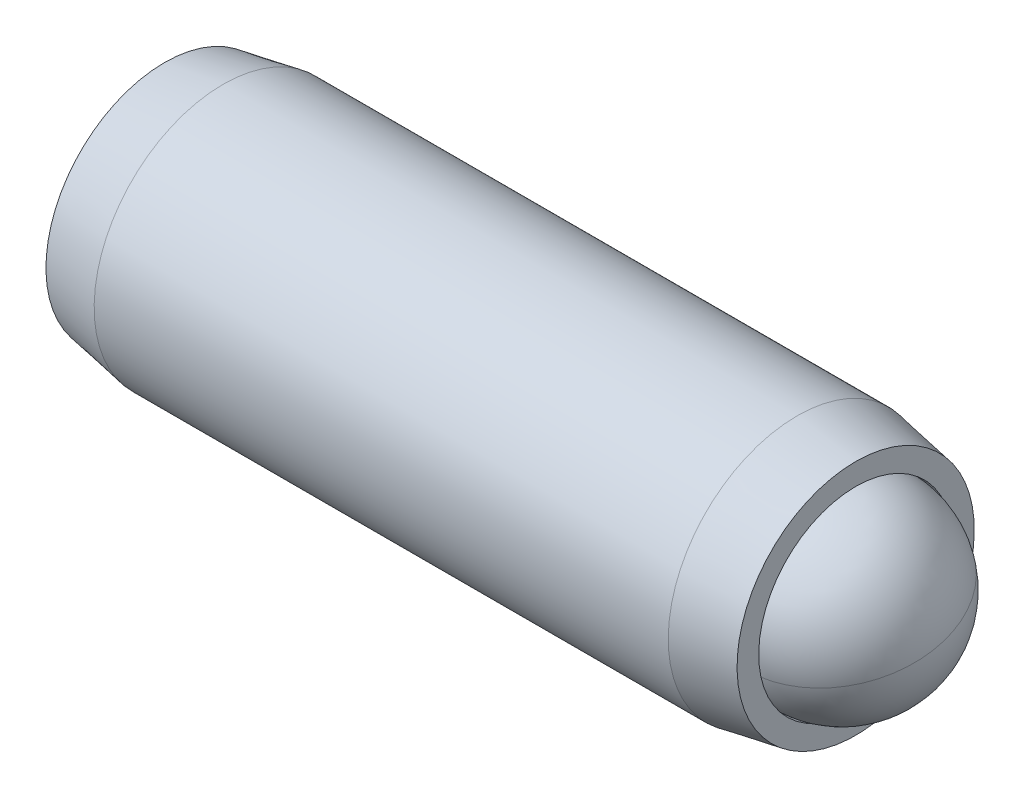
ISO-10303-21;
HEADER;
FILE_DESCRIPTION(('STEP AP214'),'2;1');
FILE_NAME('part.step','',(''),(''),'','','');
FILE_SCHEMA(('AUTOMOTIVE_DESIGN { 1 0 10303 214 1 1 1 1 }'));
ENDSEC;
DATA;
#1=APPLICATION_CONTEXT('core data for automotive mechanical design processes');
#2=APPLICATION_PROTOCOL_DEFINITION('international standard','automotive_design',2000,#1);
#3=PRODUCT_CONTEXT('',#1,'mechanical');
#4=PRODUCT('Part','Part','',(#3));
#5=PRODUCT_RELATED_PRODUCT_CATEGORY('part','',(#4));
#6=PRODUCT_DEFINITION_FORMATION('','',#4);
#7=PRODUCT_DEFINITION_CONTEXT('part definition',#1,'design');
#8=PRODUCT_DEFINITION('design','',#6,#7);
#9=PRODUCT_DEFINITION_SHAPE('','',#8);
#10=(LENGTH_UNIT() NAMED_UNIT(*) SI_UNIT(.MILLI.,.METRE.));
#11=(NAMED_UNIT(*) PLANE_ANGLE_UNIT() SI_UNIT($,.RADIAN.));
#12=(NAMED_UNIT(*) SI_UNIT($,.STERADIAN.) SOLID_ANGLE_UNIT());
#13=UNCERTAINTY_MEASURE_WITH_UNIT(LENGTH_MEASURE(1.E-05),#10,'distance_accuracy_value','');
#14=(GEOMETRIC_REPRESENTATION_CONTEXT(3) GLOBAL_UNCERTAINTY_ASSIGNED_CONTEXT((#13)) GLOBAL_UNIT_ASSIGNED_CONTEXT((#10,
#11,#12)) REPRESENTATION_CONTEXT('',''));
#15=CARTESIAN_POINT('',(0.,0.,0.));
#16=DIRECTION('',(0.,0.,1.));
#17=DIRECTION('',(1.,0.,0.));
#18=AXIS2_PLACEMENT_3D('',#15,#16,#17);
#19=CARTESIAN_POINT('',(-11.2263459470191,2.7420499882851,-0.965131231055238));
#20=DIRECTION('',(-1.,0.,0.));
#21=DIRECTION('',(0.,-1.,0.));
#22=AXIS2_PLACEMENT_3D('',#19,#20,#21);
#23=PLANE('',#22);
#24=DIRECTION('',(0.,0.866025403784439,-0.5));
#25=VECTOR('',#24,1.);
#26=CARTESIAN_POINT('',(-11.2263459470191,2.61504998828509,-2.33078112403965));
#27=LINE('',#26,#25);
#28=CARTESIAN_POINT('',(-11.2263459470191,1.49586248828509,-1.68461791964099));
#29=VERTEX_POINT('',#28);
#30=CARTESIAN_POINT('',(-11.2263459470191,2.74204998828509,-2.40410460822674));
#31=VERTEX_POINT('',#30);
#32=EDGE_CURVE('P0_E164',#29,#31,#27,.T.);
#33=ORIENTED_EDGE('',*,*,#32,.T.);
#34=DIRECTION('',(0.,0.866025403784439,0.5));
#35=VECTOR('',#34,1.);
#36=CARTESIAN_POINT('',(-11.2263459470191,3.8612374882851,-1.75794140382807));
#37=LINE('',#36,#35);
#38=CARTESIAN_POINT('',(-11.2263459470191,3.9882374882851,-1.68461791964099));
#39=VERTEX_POINT('',#38);
#40=EDGE_CURVE('P0_E166',#31,#39,#37,.T.);
#41=ORIENTED_EDGE('',*,*,#40,.T.);
#42=DIRECTION('',(0.,0.,1.));
#43=VECTOR('',#42,1.);
#44=CARTESIAN_POINT('',(-11.2263459470191,3.9882374882851,-0.392291510843657));
#45=LINE('',#44,#43);
#46=CARTESIAN_POINT('',(-11.2263459470191,3.9882374882851,-0.24564454246949));
#47=VERTEX_POINT('',#46);
#48=EDGE_CURVE('P0_E156',#39,#47,#45,.T.);
#49=ORIENTED_EDGE('',*,*,#48,.T.);
#50=DIRECTION('',(0.,-0.866025403784438,0.5));
#51=VECTOR('',#50,1.);
#52=CARTESIAN_POINT('',(-11.2263459470191,2.8690499882851,0.400518661929176));
#53=LINE('',#52,#51);
#54=CARTESIAN_POINT('',(-11.2263459470191,2.7420499882851,0.47384214611626));
#55=VERTEX_POINT('',#54);
#56=EDGE_CURVE('P0_E158',#47,#55,#53,.T.);
#57=ORIENTED_EDGE('',*,*,#56,.T.);
#58=DIRECTION('',(0.,-0.866025403784439,-0.5));
#59=VECTOR('',#58,1.);
#60=CARTESIAN_POINT('',(-11.2263459470191,1.62286248828509,-0.172321058282406));
#61=LINE('',#60,#59);
#62=CARTESIAN_POINT('',(-11.2263459470191,1.49586248828509,-0.245644542469489));
#63=VERTEX_POINT('',#62);
#64=EDGE_CURVE('P0_E160',#55,#63,#61,.T.);
#65=ORIENTED_EDGE('',*,*,#64,.T.);
#66=DIRECTION('',(0.,0.,-1.));
#67=VECTOR('',#66,1.);
#68=CARTESIAN_POINT('',(-11.2263459470191,1.49586248828509,-1.53797095126682));
#69=LINE('',#68,#67);
#70=EDGE_CURVE('P0_E162',#63,#29,#69,.T.);
#71=ORIENTED_EDGE('',*,*,#70,.T.);
#72=EDGE_LOOP('',(#33,#41,#49,#57,#65,#71));
#73=FACE_BOUND('',#72,.T.);
#74=CARTESIAN_POINT('',(-11.2263459470191,2.7420499882851,-0.965131231055238));
#75=DIRECTION('',(1.,0.,0.));
#76=DIRECTION('',(0.,1.,0.));
#77=AXIS2_PLACEMENT_3D('',#74,#75,#76);
#78=CIRCLE('',#77,2.921);
#79=CARTESIAN_POINT('',(-11.2263459470191,5.66304998828509,-0.965131231055238));
#80=VERTEX_POINT('',#79);
#81=EDGE_CURVE('P0_E150',#80,#80,#78,.T.);
#82=ORIENTED_EDGE('',*,*,#81,.F.);
#83=EDGE_LOOP('',(#82));
#84=FACE_BOUND('',#83,.T.);
#85=ADVANCED_FACE('P0_F17',(#73,#84),#23,.T.);
#86=CARTESIAN_POINT('',(-9.78584036483622,2.7420499882851,-0.965131231055238));
#87=DIRECTION('',(1.,0.,0.));
#88=DIRECTION('',(0.,1.,0.));
#89=AXIS2_PLACEMENT_3D('',#86,#87,#88);
#90=CONICAL_SURFACE('',#89,3.175,0.174532925199434);
#91=ORIENTED_EDGE('',*,*,#81,.T.);
#92=EDGE_LOOP('',(#91));
#93=FACE_BOUND('',#92,.T.);
#94=CARTESIAN_POINT('',(-9.78584036483622,2.7420499882851,-0.965131231055238));
#95=DIRECTION('',(1.,0.,0.));
#96=DIRECTION('',(0.,1.,0.));
#97=AXIS2_PLACEMENT_3D('',#94,#95,#96);
#98=CIRCLE('',#97,3.175);
#99=CARTESIAN_POINT('',(-9.78584036483622,5.9170499882851,-0.965131231055238));
#100=VERTEX_POINT('',#99);
#101=EDGE_CURVE('P0_E147',#100,#100,#98,.T.);
#102=ORIENTED_EDGE('',*,*,#101,.F.);
#103=EDGE_LOOP('',(#102));
#104=FACE_BOUND('',#103,.T.);
#105=ADVANCED_FACE('P0_F225',(#93,#104),#90,.T.);
#106=CARTESIAN_POINT('',(2.07480800757997,2.7420499882851,-0.965131231055238));
#107=DIRECTION('',(1.,0.,0.));
#108=DIRECTION('',(0.,1.,0.));
#109=AXIS2_PLACEMENT_3D('',#106,#107,#108);
#110=CYLINDRICAL_SURFACE('',#109,3.175);
#111=ORIENTED_EDGE('',*,*,#101,.T.);
#112=EDGE_LOOP('',(#111));
#113=FACE_BOUND('',#112,.T.);
#114=CARTESIAN_POINT('',(4.351148470798,2.7420499882851,-0.965131231055238));
#115=DIRECTION('',(1.,0.,0.));
#116=DIRECTION('',(0.,1.,0.));
#117=AXIS2_PLACEMENT_3D('',#114,#115,#116);
#118=CIRCLE('',#117,3.175);
#119=CARTESIAN_POINT('',(4.351148470798,5.9170499882851,-0.965131231055238));
#120=VERTEX_POINT('',#119);
#121=EDGE_CURVE('P0_E144',#120,#120,#118,.T.);
#122=ORIENTED_EDGE('',*,*,#121,.F.);
#123=EDGE_LOOP('',(#122));
#124=FACE_BOUND('',#123,.T.);
#125=ADVANCED_FACE('P0_F231',(#113,#124),#110,.T.);
#126=CARTESIAN_POINT('',(5.79165405298089,2.7420499882851,-0.965131231055238));
#127=DIRECTION('',(-1.,0.,0.));
#128=DIRECTION('',(0.,-1.,0.));
#129=AXIS2_PLACEMENT_3D('',#126,#127,#128);
#130=CONICAL_SURFACE('',#129,2.921,0.174532925199434);
#131=ORIENTED_EDGE('',*,*,#121,.T.);
#132=EDGE_LOOP('',(#131));
#133=FACE_BOUND('',#132,.T.);
#134=CARTESIAN_POINT('',(5.79165405298089,2.7420499882851,-0.965131231055238));
#135=DIRECTION('',(1.,0.,0.));
#136=DIRECTION('',(0.,1.,0.));
#137=AXIS2_PLACEMENT_3D('',#134,#135,#136);
#138=CIRCLE('',#137,2.921);
#139=CARTESIAN_POINT('',(5.79165405298089,5.66304998828509,-0.965131231055238));
#140=VERTEX_POINT('',#139);
#141=EDGE_CURVE('P0_E141',#140,#140,#138,.T.);
#142=ORIENTED_EDGE('',*,*,#141,.F.);
#143=EDGE_LOOP('',(#142));
#144=FACE_BOUND('',#143,.T.);
#145=ADVANCED_FACE('P0_F275',(#133,#144),#130,.T.);
#146=CARTESIAN_POINT('',(5.79165405298089,5.66304998828509,-0.965131231055238));
#147=DIRECTION('',(1.,0.,0.));
#148=DIRECTION('',(0.,1.,0.));
#149=AXIS2_PLACEMENT_3D('',#146,#147,#148);
#150=PLANE('',#149);
#151=ORIENTED_EDGE('',*,*,#141,.T.);
#152=EDGE_LOOP('',(#151));
#153=FACE_BOUND('',#152,.T.);
#154=CARTESIAN_POINT('',(5.79165405298089,2.7420499882851,-0.965131231055238));
#155=DIRECTION('',(1.,0.,0.));
#156=DIRECTION('',(0.,1.,0.));
#157=AXIS2_PLACEMENT_3D('',#154,#155,#156);
#158=CIRCLE('',#157,2.3876);
#159=CARTESIAN_POINT('',(5.79165405298089,5.1296499882851,-0.965131231055238));
#160=VERTEX_POINT('',#159);
#161=EDGE_CURVE('P0_E138',#160,#160,#158,.T.);
#162=ORIENTED_EDGE('',*,*,#161,.F.);
#163=EDGE_LOOP('',(#162));
#164=FACE_BOUND('',#163,.T.);
#165=ADVANCED_FACE('P0_F271',(#153,#164),#150,.T.);
#166=CARTESIAN_POINT('',(2.07480800757997,2.7420499882851,-0.965131231055238));
#167=DIRECTION('',(1.,0.,0.));
#168=DIRECTION('',(0.,1.,0.));
#169=AXIS2_PLACEMENT_3D('',#166,#167,#168);
#170=CYLINDRICAL_SURFACE('',#169,2.3876);
#171=ORIENTED_EDGE('',*,*,#161,.T.);
#172=EDGE_LOOP('',(#171));
#173=FACE_BOUND('',#172,.T.);
#174=CARTESIAN_POINT('',(4.46240800757996,2.7420499882851,-0.965131231055238));
#175=DIRECTION('',(1.,0.,0.));
#176=DIRECTION('',(0.,1.,0.));
#177=AXIS2_PLACEMENT_3D('',#174,#175,#176);
#178=CIRCLE('',#177,2.3876);
#179=CARTESIAN_POINT('',(4.46240800757996,5.1296499882851,-0.965131231055238));
#180=VERTEX_POINT('',#179);
#181=EDGE_CURVE('P0_E126',#180,#180,#178,.T.);
#182=ORIENTED_EDGE('',*,*,#181,.F.);
#183=EDGE_LOOP('',(#182));
#184=FACE_BOUND('',#183,.T.);
#185=ADVANCED_FACE('P0_F267',(#173,#184),#170,.F.);
#186=CARTESIAN_POINT('',(2.07480800757997,2.7420499882851,-0.965131231055238));
#187=DIRECTION('',(1.,0.,0.));
#188=DIRECTION('',(0.,1.,0.));
#189=AXIS2_PLACEMENT_3D('',#186,#187,#188);
#190=CONICAL_SURFACE('',#189,0.,0.78539816339745);
#191=ORIENTED_EDGE('',*,*,#181,.T.);
#192=EDGE_LOOP('',(#191));
#193=FACE_BOUND('',#192,.T.);
#194=CARTESIAN_POINT('',(2.07480800757997,2.7420499882851,-0.965131231055238));
#195=VERTEX_POINT('',#194);
#196=VERTEX_LOOP('',#195);
#197=FACE_BOUND('',#196,.T.);
#198=ADVANCED_FACE('P0_F221',(#193,#197),#190,.F.);
#199=CARTESIAN_POINT('',(-8.17834594701911,2.7420499882851,0.180548209367925));
#200=DIRECTION('',(0.,0.5,0.866025403784438));
#201=DIRECTION('',(0.,-0.866025403784439,0.5));
#202=AXIS2_PLACEMENT_3D('',#199,#200,#201);
#203=PLANE('',#202);
#204=DIRECTION('',(-1.,0.,0.));
#205=VECTOR('',#204,1.);
#206=CARTESIAN_POINT('',(-8.17834594701911,2.7420499882851,0.180548209367925));
#207=LINE('',#206,#205);
#208=CARTESIAN_POINT('',(-8.17834594701911,2.7420499882851,0.180548209367925));
#209=VERTEX_POINT('',#208);
#210=CARTESIAN_POINT('',(-10.9723459470191,2.7420499882851,0.180548209367925));
#211=VERTEX_POINT('',#210);
#212=EDGE_CURVE('P0_E124',#209,#211,#207,.T.);
#213=ORIENTED_EDGE('',*,*,#212,.T.);
#214=DIRECTION('',(0.,0.866025403784439,-0.5));
#215=VECTOR('',#214,1.);
#216=CARTESIAN_POINT('',(-10.9723459470191,3.7342374882851,-0.392291510843657));
#217=LINE('',#216,#215);
#218=CARTESIAN_POINT('',(-10.9723459470191,3.7342374882851,-0.392291510843657));
#219=VERTEX_POINT('',#218);
#220=EDGE_CURVE('P0_E26',#211,#219,#217,.T.);
#221=ORIENTED_EDGE('',*,*,#220,.T.);
#222=DIRECTION('',(-1.,0.,0.));
#223=VECTOR('',#222,1.);
#224=CARTESIAN_POINT('',(-8.17834594701911,3.7342374882851,-0.392291510843657));
#225=LINE('',#224,#223);
#226=CARTESIAN_POINT('',(-8.17834594701911,3.7342374882851,-0.392291510843657));
#227=VERTEX_POINT('',#226);
#228=EDGE_CURVE('P0_E90',#227,#219,#225,.T.);
#229=ORIENTED_EDGE('',*,*,#228,.F.);
#230=DIRECTION('',(0.,0.866025403784438,-0.5));
#231=VECTOR('',#230,1.);
#232=CARTESIAN_POINT('',(-8.17834594701911,2.7420499882851,0.180548209367925));
#233=LINE('',#232,#231);
#234=EDGE_CURVE('P0_E94',#209,#227,#233,.T.);
#235=ORIENTED_EDGE('',*,*,#234,.F.);
#236=EDGE_LOOP('',(#213,#221,#229,#235));
#237=FACE_BOUND('',#236,.T.);
#238=ADVANCED_FACE('P0_F92',(#237),#203,.F.);
#239=CARTESIAN_POINT('',(-8.17834594701911,1.7498624882851,-0.392291510843657));
#240=DIRECTION('',(0.,-0.5,0.866025403784439));
#241=DIRECTION('',(0.,-0.866025403784439,-0.5));
#242=AXIS2_PLACEMENT_3D('',#239,#240,#241);
#243=PLANE('',#242);
#244=DIRECTION('',(-1.,0.,0.));
#245=VECTOR('',#244,1.);
#246=CARTESIAN_POINT('',(-8.17834594701911,1.7498624882851,-0.392291510843657));
#247=LINE('',#246,#245);
#248=CARTESIAN_POINT('',(-8.17834594701911,1.7498624882851,-0.392291510843657));
#249=VERTEX_POINT('',#248);
#250=CARTESIAN_POINT('',(-10.9723459470191,1.7498624882851,-0.392291510843657));
#251=VERTEX_POINT('',#250);
#252=EDGE_CURVE('P0_E127',#249,#251,#247,.T.);
#253=ORIENTED_EDGE('',*,*,#252,.T.);
#254=DIRECTION('',(0.,0.866025403784439,0.5));
#255=VECTOR('',#254,1.);
#256=CARTESIAN_POINT('',(-10.9723459470191,2.7420499882851,0.180548209367925));
#257=LINE('',#256,#255);
#258=EDGE_CURVE('P0_E41',#251,#211,#257,.T.);
#259=ORIENTED_EDGE('',*,*,#258,.T.);
#260=ORIENTED_EDGE('',*,*,#212,.F.);
#261=DIRECTION('',(0.,0.866025403784439,0.5));
#262=VECTOR('',#261,1.);
#263=CARTESIAN_POINT('',(-8.17834594701911,1.7498624882851,-0.392291510843657));
#264=LINE('',#263,#262);
#265=EDGE_CURVE('P0_E99',#249,#209,#264,.T.);
#266=ORIENTED_EDGE('',*,*,#265,.F.);
#267=EDGE_LOOP('',(#253,#259,#260,#266));
#268=FACE_BOUND('',#267,.T.);
#269=ADVANCED_FACE('P0_F212',(#268),#243,.F.);
#270=CARTESIAN_POINT('',(-8.17834594701911,1.7498624882851,-1.53797095126682));
#271=DIRECTION('',(0.,-1.,0.));
#272=DIRECTION('',(0.,0.,-1.));
#273=AXIS2_PLACEMENT_3D('',#270,#271,#272);
#274=PLANE('',#273);
#275=DIRECTION('',(-1.,0.,0.));
#276=VECTOR('',#275,1.);
#277=CARTESIAN_POINT('',(-8.17834594701911,1.7498624882851,-1.53797095126682));
#278=LINE('',#277,#276);
#279=CARTESIAN_POINT('',(-8.17834594701911,1.7498624882851,-1.53797095126682));
#280=VERTEX_POINT('',#279);
#281=CARTESIAN_POINT('',(-10.9723459470191,1.7498624882851,-1.53797095126682));
#282=VERTEX_POINT('',#281);
#283=EDGE_CURVE('P0_E129',#280,#282,#278,.T.);
#284=ORIENTED_EDGE('',*,*,#283,.T.);
#285=DIRECTION('',(0.,0.,1.));
#286=VECTOR('',#285,1.);
#287=CARTESIAN_POINT('',(-10.9723459470191,1.7498624882851,-0.392291510843657));
#288=LINE('',#287,#286);
#289=EDGE_CURVE('P0_E171',#282,#251,#288,.T.);
#290=ORIENTED_EDGE('',*,*,#289,.T.);
#291=ORIENTED_EDGE('',*,*,#252,.F.);
#292=DIRECTION('',(0.,0.,1.));
#293=VECTOR('',#292,1.);
#294=CARTESIAN_POINT('',(-8.17834594701911,1.7498624882851,-1.53797095126682));
#295=LINE('',#294,#293);
#296=EDGE_CURVE('P0_E121',#280,#249,#295,.T.);
#297=ORIENTED_EDGE('',*,*,#296,.F.);
#298=EDGE_LOOP('',(#284,#290,#291,#297));
#299=FACE_BOUND('',#298,.T.);
#300=ADVANCED_FACE('P0_F211',(#299),#274,.F.);
#301=CARTESIAN_POINT('',(-8.17834594701911,2.7420499882851,-2.1108106714784));
#302=DIRECTION('',(0.,-0.5,-0.866025403784439));
#303=DIRECTION('',(0.,0.866025403784439,-0.5));
#304=AXIS2_PLACEMENT_3D('',#301,#302,#303);
#305=PLANE('',#304);
#306=DIRECTION('',(-1.,0.,0.));
#307=VECTOR('',#306,1.);
#308=CARTESIAN_POINT('',(-8.17834594701911,2.7420499882851,-2.1108106714784));
#309=LINE('',#308,#307);
#310=CARTESIAN_POINT('',(-8.17834594701911,2.7420499882851,-2.1108106714784));
#311=VERTEX_POINT('',#310);
#312=CARTESIAN_POINT('',(-10.9723459470191,2.7420499882851,-2.1108106714784));
#313=VERTEX_POINT('',#312);
#314=EDGE_CURVE('P0_E132',#311,#313,#309,.T.);
#315=ORIENTED_EDGE('',*,*,#314,.T.);
#316=DIRECTION('',(0.,-0.866025403784439,0.5));
#317=VECTOR('',#316,1.);
#318=CARTESIAN_POINT('',(-10.9723459470191,1.7498624882851,-1.53797095126682));
#319=LINE('',#318,#317);
#320=EDGE_CURVE('P0_E169',#313,#282,#319,.T.);
#321=ORIENTED_EDGE('',*,*,#320,.T.);
#322=ORIENTED_EDGE('',*,*,#283,.F.);
#323=DIRECTION('',(0.,-0.866025403784439,0.5));
#324=VECTOR('',#323,1.);
#325=CARTESIAN_POINT('',(-8.17834594701911,2.7420499882851,-2.1108106714784));
#326=LINE('',#325,#324);
#327=EDGE_CURVE('P0_E118',#311,#280,#326,.T.);
#328=ORIENTED_EDGE('',*,*,#327,.F.);
#329=EDGE_LOOP('',(#315,#321,#322,#328));
#330=FACE_BOUND('',#329,.T.);
#331=ADVANCED_FACE('P0_F208',(#330),#305,.F.);
#332=CARTESIAN_POINT('',(-8.17834594701911,3.7342374882851,-1.53797095126682));
#333=DIRECTION('',(0.,0.499999999999999,-0.866025403784439));
#334=DIRECTION('',(0.,0.866025403784439,0.5));
#335=AXIS2_PLACEMENT_3D('',#332,#333,#334);
#336=PLANE('',#335);
#337=DIRECTION('',(-1.,0.,0.));
#338=VECTOR('',#337,1.);
#339=CARTESIAN_POINT('',(-8.17834594701911,3.7342374882851,-1.53797095126682));
#340=LINE('',#339,#338);
#341=CARTESIAN_POINT('',(-8.17834594701911,3.7342374882851,-1.53797095126682));
#342=VERTEX_POINT('',#341);
#343=CARTESIAN_POINT('',(-10.9723459470191,3.7342374882851,-1.53797095126682));
#344=VERTEX_POINT('',#343);
#345=EDGE_CURVE('P0_E98',#342,#344,#340,.T.);
#346=ORIENTED_EDGE('',*,*,#345,.T.);
#347=DIRECTION('',(0.,-0.866025403784439,-0.5));
#348=VECTOR('',#347,1.);
#349=CARTESIAN_POINT('',(-10.9723459470191,2.7420499882851,-2.1108106714784));
#350=LINE('',#349,#348);
#351=EDGE_CURVE('P0_E153',#344,#313,#350,.T.);
#352=ORIENTED_EDGE('',*,*,#351,.T.);
#353=ORIENTED_EDGE('',*,*,#314,.F.);
#354=DIRECTION('',(0.,-0.866025403784439,-0.5));
#355=VECTOR('',#354,1.);
#356=CARTESIAN_POINT('',(-8.17834594701911,3.7342374882851,-1.53797095126682));
#357=LINE('',#356,#355);
#358=EDGE_CURVE('P0_E108',#342,#311,#357,.T.);
#359=ORIENTED_EDGE('',*,*,#358,.F.);
#360=EDGE_LOOP('',(#346,#352,#353,#359));
#361=FACE_BOUND('',#360,.T.);
#362=ADVANCED_FACE('P0_F204',(#361),#336,.F.);
#363=CARTESIAN_POINT('',(-8.17834594701911,3.7342374882851,-0.392291510843657));
#364=DIRECTION('',(0.,1.,0.));
#365=DIRECTION('',(-1.,0.,0.));
#366=AXIS2_PLACEMENT_3D('',#363,#364,#365);
#367=PLANE('',#366);
#368=ORIENTED_EDGE('',*,*,#228,.T.);
#369=DIRECTION('',(0.,0.,-1.));
#370=VECTOR('',#369,1.);
#371=CARTESIAN_POINT('',(-10.9723459470191,3.7342374882851,-1.53797095126682));
#372=LINE('',#371,#370);
#373=EDGE_CURVE('P0_E11',#219,#344,#372,.T.);
#374=ORIENTED_EDGE('',*,*,#373,.T.);
#375=ORIENTED_EDGE('',*,*,#345,.F.);
#376=DIRECTION('',(0.,0.,-1.));
#377=VECTOR('',#376,1.);
#378=CARTESIAN_POINT('',(-8.17834594701911,3.7342374882851,-0.392291510843657));
#379=LINE('',#378,#377);
#380=EDGE_CURVE('P0_E102',#227,#342,#379,.T.);
#381=ORIENTED_EDGE('',*,*,#380,.F.);
#382=EDGE_LOOP('',(#368,#374,#375,#381));
#383=FACE_BOUND('',#382,.T.);
#384=ADVANCED_FACE('P0_F103',(#383),#367,.F.);
#385=CARTESIAN_POINT('',(-8.17834594701911,4.7264249882851,-0.96513123105524));
#386=DIRECTION('',(-1.,0.,0.));
#387=DIRECTION('',(0.,0.,1.));
#388=AXIS2_PLACEMENT_3D('',#385,#386,#387);
#389=PLANE('',#388);
#390=ORIENTED_EDGE('',*,*,#234,.T.);
#391=ORIENTED_EDGE('',*,*,#380,.T.);
#392=ORIENTED_EDGE('',*,*,#358,.T.);
#393=ORIENTED_EDGE('',*,*,#327,.T.);
#394=ORIENTED_EDGE('',*,*,#296,.T.);
#395=ORIENTED_EDGE('',*,*,#265,.T.);
#396=EDGE_LOOP('',(#390,#391,#392,#393,#394,#395));
#397=FACE_BOUND('',#396,.T.);
#398=ADVANCED_FACE('P0_F110',(#397),#389,.T.);
#399=CARTESIAN_POINT('',(-10.9723459470191,1.7498624882851,-0.392291510843657));
#400=DIRECTION('',(-0.707106781186545,0.353553390593275,-0.612372435695797));
#401=DIRECTION('',(-0.65465367070798,0.,0.755928946018452));
#402=AXIS2_PLACEMENT_3D('',#399,#400,#401);
#403=PLANE('',#402);
#404=DIRECTION('',(-0.65465367070798,-0.654653670707975,0.377964473009227));
#405=VECTOR('',#404,1.);
#406=CARTESIAN_POINT('',(-10.688863804162,2.03334463114224,-0.55596000233268));
#407=LINE('',#406,#405);
#408=EDGE_CURVE('P0_E115',#63,#251,#407,.F.);
#409=ORIENTED_EDGE('',*,*,#408,.F.);
#410=ORIENTED_EDGE('',*,*,#64,.F.);
#411=DIRECTION('',(-0.65465367070798,0.,0.755928946018452));
#412=VECTOR('',#411,1.);
#413=CARTESIAN_POINT('',(-10.688863804162,2.7420499882851,-0.146788773610119));
#414=LINE('',#413,#412);
#415=EDGE_CURVE('P0_E21',#211,#55,#414,.T.);
#416=ORIENTED_EDGE('',*,*,#415,.F.);
#417=ORIENTED_EDGE('',*,*,#258,.F.);
#418=EDGE_LOOP('',(#409,#410,#416,#417));
#419=FACE_BOUND('',#418,.T.);
#420=ADVANCED_FACE('P0_F19',(#419),#403,.T.);
#421=CARTESIAN_POINT('',(-10.9723459470191,2.7420499882851,0.180548209367925));
#422=DIRECTION('',(-0.707106781186545,-0.353553390593275,-0.612372435695797));
#423=DIRECTION('',(-0.65465367070798,0.,0.755928946018452));
#424=AXIS2_PLACEMENT_3D('',#421,#422,#423);
#425=PLANE('',#424);
#426=ORIENTED_EDGE('',*,*,#415,.T.);
#427=ORIENTED_EDGE('',*,*,#56,.F.);
#428=DIRECTION('',(-0.65465367070798,0.654653670707975,0.377964473009226));
#429=VECTOR('',#428,1.);
#430=CARTESIAN_POINT('',(-10.688863804162,3.45075534542796,-0.555960002332679));
#431=LINE('',#430,#429);
#432=EDGE_CURVE('P0_E182',#219,#47,#431,.T.);
#433=ORIENTED_EDGE('',*,*,#432,.F.);
#434=ORIENTED_EDGE('',*,*,#220,.F.);
#435=EDGE_LOOP('',(#426,#427,#433,#434));
#436=FACE_BOUND('',#435,.T.);
#437=ADVANCED_FACE('P0_F196',(#436),#425,.T.);
#438=CARTESIAN_POINT('',(-10.9723459470191,1.7498624882851,-1.53797095126682));
#439=DIRECTION('',(-0.707106781186545,0.70710678118655,0.));
#440=DIRECTION('',(-0.70710678118655,-0.707106781186545,0.));
#441=AXIS2_PLACEMENT_3D('',#438,#439,#440);
#442=PLANE('',#441);
#443=ORIENTED_EDGE('',*,*,#408,.T.);
#444=ORIENTED_EDGE('',*,*,#289,.F.);
#445=DIRECTION('',(-0.654653670707979,-0.654653670707975,-0.377964473009227));
#446=VECTOR('',#445,1.);
#447=CARTESIAN_POINT('',(-10.688863804162,2.03334463114224,-1.3743024597778));
#448=LINE('',#447,#446);
#449=EDGE_CURVE('P0_E179',#29,#282,#448,.F.);
#450=ORIENTED_EDGE('',*,*,#449,.F.);
#451=ORIENTED_EDGE('',*,*,#70,.F.);
#452=EDGE_LOOP('',(#443,#444,#450,#451));
#453=FACE_BOUND('',#452,.T.);
#454=ADVANCED_FACE('P0_F189',(#453),#442,.T.);
#455=CARTESIAN_POINT('',(-10.9723459470191,3.7342374882851,-0.392291510843657));
#456=DIRECTION('',(-0.707106781186545,-0.70710678118655,0.));
#457=DIRECTION('',(0.70710678118655,-0.707106781186545,0.));
#458=AXIS2_PLACEMENT_3D('',#455,#456,#457);
#459=PLANE('',#458);
#460=ORIENTED_EDGE('',*,*,#432,.T.);
#461=ORIENTED_EDGE('',*,*,#48,.F.);
#462=DIRECTION('',(0.65465367070798,-0.654653670707975,0.377964473009226));
#463=VECTOR('',#462,1.);
#464=CARTESIAN_POINT('',(-10.9723459470191,3.7342374882851,-1.53797095126682));
#465=LINE('',#464,#463);
#466=EDGE_CURVE('P0_E177',#344,#39,#465,.F.);
#467=ORIENTED_EDGE('',*,*,#466,.F.);
#468=ORIENTED_EDGE('',*,*,#373,.F.);
#469=EDGE_LOOP('',(#460,#461,#467,#468));
#470=FACE_BOUND('',#469,.T.);
#471=ADVANCED_FACE('P0_F201',(#470),#459,.T.);
#472=CARTESIAN_POINT('',(-10.9723459470191,2.7420499882851,-2.1108106714784));
#473=DIRECTION('',(-0.707106781186546,0.353553390593275,0.612372435695796));
#474=DIRECTION('',(0.654653670707979,0.,0.755928946018453));
#475=AXIS2_PLACEMENT_3D('',#472,#473,#474);
#476=PLANE('',#475);
#477=ORIENTED_EDGE('',*,*,#449,.T.);
#478=ORIENTED_EDGE('',*,*,#320,.F.);
#479=DIRECTION('',(-0.65465367070798,0.,-0.755928946018452));
#480=VECTOR('',#479,1.);
#481=CARTESIAN_POINT('',(-10.688863804162,2.7420499882851,-1.78347368850036));
#482=LINE('',#481,#480);
#483=EDGE_CURVE('P0_E175',#31,#313,#482,.F.);
#484=ORIENTED_EDGE('',*,*,#483,.F.);
#485=ORIENTED_EDGE('',*,*,#32,.F.);
#486=EDGE_LOOP('',(#477,#478,#484,#485));
#487=FACE_BOUND('',#486,.T.);
#488=ADVANCED_FACE('P0_F240',(#487),#476,.T.);
#489=CARTESIAN_POINT('',(-10.9723459470191,3.7342374882851,-1.53797095126682));
#490=DIRECTION('',(-0.707106781186545,-0.353553390593275,0.612372435695797));
#491=DIRECTION('',(0.65465367070798,0.,0.755928946018452));
#492=AXIS2_PLACEMENT_3D('',#489,#490,#491);
#493=PLANE('',#492);
#494=ORIENTED_EDGE('',*,*,#466,.T.);
#495=ORIENTED_EDGE('',*,*,#40,.F.);
#496=ORIENTED_EDGE('',*,*,#483,.T.);
#497=ORIENTED_EDGE('',*,*,#351,.F.);
#498=EDGE_LOOP('',(#494,#495,#496,#497));
#499=FACE_BOUND('',#498,.T.);
#500=ADVANCED_FACE('P0_F237',(#499),#493,.T.);
#501=CLOSED_SHELL('',(#85,#105,#125,#145,#165,#185,#198,#238,#269,#300,#331,#362,#384,#398,#420,
#437,#454,#471,#488,#500));
#502=MANIFOLD_SOLID_BREP('P0_B1',#501);
#503=CARTESIAN_POINT('',(5.44240405298089,2.7420499882851,-0.965131231055239));
#504=DIRECTION('',(0.,0.972214232741158,0.234092899626454));
#505=DIRECTION('',(0.,0.234092899626454,-0.972214232741158));
#506=AXIS2_PLACEMENT_3D('',#503,#504,#505);
#507=SPHERICAL_SURFACE('',#506,2.38125);
#508=CARTESIAN_POINT('',(5.44240405298089,2.7420499882851,-0.965131231055239));
#509=DIRECTION('',(1.,0.,0.));
#510=DIRECTION('',(0.,0.234092899626454,-0.972214232741158));
#511=AXIS2_PLACEMENT_3D('',#508,#509,#510);
#512=CIRCLE('',#511,2.38125);
#513=CARTESIAN_POINT('',(5.44240405298089,3.29948370552059,-3.28021637277012));
#514=VERTEX_POINT('',#513);
#515=CARTESIAN_POINT('',(5.44240405298089,2.1846162710496,1.34995391065964));
#516=VERTEX_POINT('',#515);
#517=EDGE_CURVE('P1_E33',#514,#516,#512,.T.);
#518=ORIENTED_EDGE('',*,*,#517,.T.);
#519=CARTESIAN_POINT('',(5.44240405298089,2.7420499882851,-0.965131231055239));
#520=DIRECTION('',(0.,0.972214232741158,0.234092899626454));
#521=DIRECTION('',(1.,0.,0.));
#522=AXIS2_PLACEMENT_3D('',#519,#520,#521);
#523=CIRCLE('',#522,2.38125);
#524=EDGE_CURVE('P1_E10',#516,#514,#523,.T.);
#525=ORIENTED_EDGE('',*,*,#524,.T.);
#526=EDGE_LOOP('',(#518,#525));
#527=FACE_BOUND('',#526,.T.);
#528=ADVANCED_FACE('P1_F16',(#527),#507,.T.);
#529=ORIENTED_EDGE('',*,*,#517,.F.);
#530=CARTESIAN_POINT('',(5.44240405298089,2.7420499882851,-0.965131231055239));
#531=DIRECTION('',(0.,0.972214232741158,0.234092899626454));
#532=DIRECTION('',(1.,0.,0.));
#533=AXIS2_PLACEMENT_3D('',#530,#531,#532);
#534=CIRCLE('',#533,2.38125);
#535=EDGE_CURVE('P1_E23',#514,#516,#534,.T.);
#536=ORIENTED_EDGE('',*,*,#535,.T.);
#537=EDGE_LOOP('',(#529,#536));
#538=FACE_BOUND('',#537,.T.);
#539=ADVANCED_FACE('P1_F40',(#538),#507,.T.);
#540=ORIENTED_EDGE('',*,*,#524,.F.);
#541=EDGE_CURVE('P1_E36',#516,#514,#512,.T.);
#542=ORIENTED_EDGE('',*,*,#541,.T.);
#543=EDGE_LOOP('',(#540,#542));
#544=FACE_BOUND('',#543,.T.);
#545=ADVANCED_FACE('P1_F38',(#544),#507,.T.);
#546=ORIENTED_EDGE('',*,*,#535,.F.);
#547=ORIENTED_EDGE('',*,*,#541,.F.);
#548=EDGE_LOOP('',(#546,#547));
#549=FACE_BOUND('',#548,.T.);
#550=ADVANCED_FACE('P1_F18',(#549),#507,.T.);
#551=CLOSED_SHELL('',(#528,#539,#545,#550));
#552=MANIFOLD_SOLID_BREP('P1_B1',#551);
#553=ADVANCED_BREP_SHAPE_REPRESENTATION('',(#18,#502,#552),#14);
#554=SHAPE_DEFINITION_REPRESENTATION(#9,#553);
ENDSEC;
END-ISO-10303-21;
